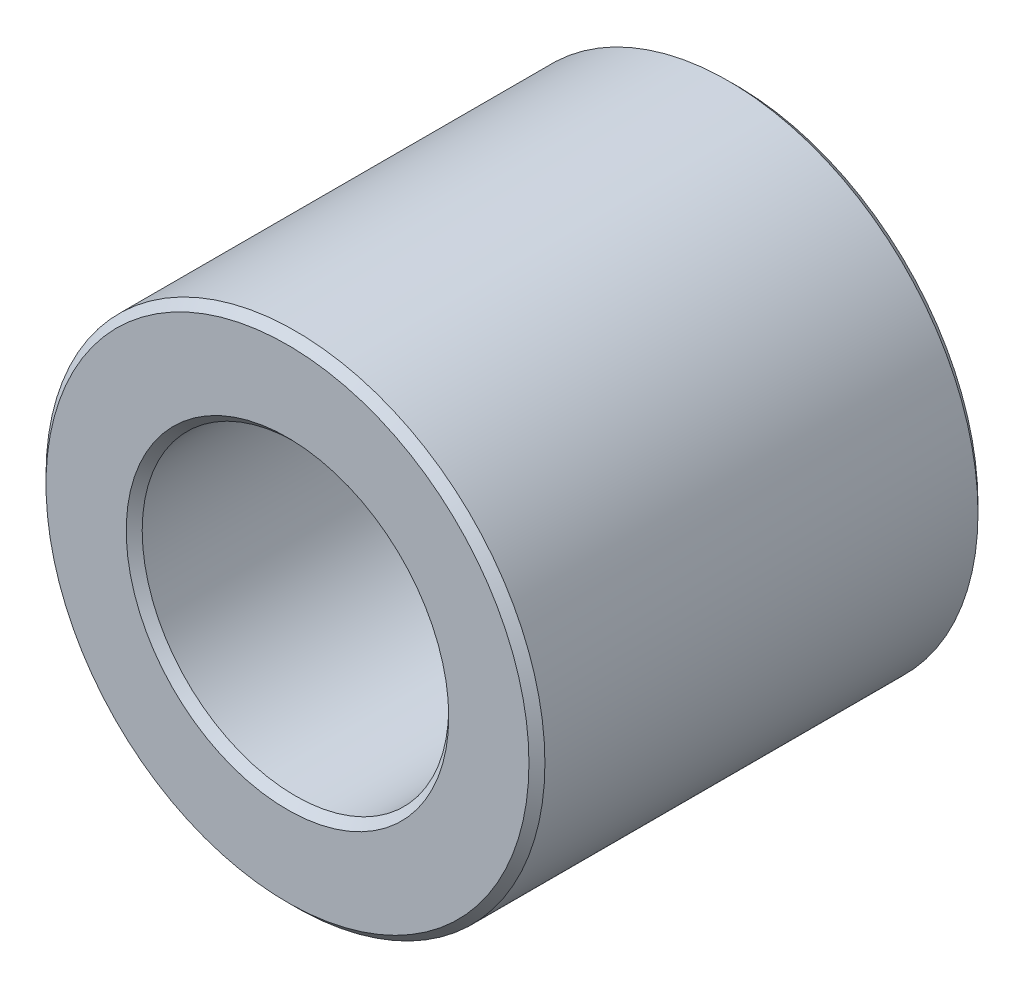
ISO-10303-21;
HEADER;
FILE_DESCRIPTION(('STEP AP214'),'2;1');
FILE_NAME('part.step','',(''),(''),'','','');
FILE_SCHEMA(('AUTOMOTIVE_DESIGN { 1 0 10303 214 1 1 1 1 }'));
ENDSEC;
DATA;
#1=APPLICATION_CONTEXT('core data for automotive mechanical design processes');
#2=APPLICATION_PROTOCOL_DEFINITION('international standard','automotive_design',2000,#1);
#3=PRODUCT_CONTEXT('',#1,'mechanical');
#4=PRODUCT('Part','Part','',(#3));
#5=PRODUCT_RELATED_PRODUCT_CATEGORY('part','',(#4));
#6=PRODUCT_DEFINITION_FORMATION('','',#4);
#7=PRODUCT_DEFINITION_CONTEXT('part definition',#1,'design');
#8=PRODUCT_DEFINITION('design','',#6,#7);
#9=PRODUCT_DEFINITION_SHAPE('','',#8);
#10=(LENGTH_UNIT() NAMED_UNIT(*) SI_UNIT(.MILLI.,.METRE.));
#11=(NAMED_UNIT(*) PLANE_ANGLE_UNIT() SI_UNIT($,.RADIAN.));
#12=(NAMED_UNIT(*) SI_UNIT($,.STERADIAN.) SOLID_ANGLE_UNIT());
#13=UNCERTAINTY_MEASURE_WITH_UNIT(LENGTH_MEASURE(1.E-05),#10,'distance_accuracy_value','');
#14=(GEOMETRIC_REPRESENTATION_CONTEXT(3) GLOBAL_UNCERTAINTY_ASSIGNED_CONTEXT((#13)) GLOBAL_UNIT_ASSIGNED_CONTEXT((#10,
#11,#12)) REPRESENTATION_CONTEXT('',''));
#15=CARTESIAN_POINT('',(0.,0.,0.));
#16=DIRECTION('',(0.,0.,1.));
#17=DIRECTION('',(1.,0.,0.));
#18=AXIS2_PLACEMENT_3D('',#15,#16,#17);
#19=CARTESIAN_POINT('',(0.,0.,-3.571875));
#20=DIRECTION('',(0.,0.,1.));
#21=DIRECTION('',(1.,0.,0.));
#22=AXIS2_PLACEMENT_3D('',#19,#20,#21);
#23=CYLINDRICAL_SURFACE('',#22,3.96875);
#24=CARTESIAN_POINT('',(0.,0.,-3.444875));
#25=DIRECTION('',(0.,0.,1.));
#26=DIRECTION('',(1.,0.,0.));
#27=AXIS2_PLACEMENT_3D('',#24,#25,#26);
#28=CIRCLE('',#27,3.96875);
#29=CARTESIAN_POINT('',(3.96875,0.,-3.444875));
#30=VERTEX_POINT('',#29);
#31=EDGE_CURVE('E10',#30,#30,#28,.T.);
#32=ORIENTED_EDGE('',*,*,#31,.T.);
#33=EDGE_LOOP('',(#32));
#34=FACE_BOUND('',#33,.T.);
#35=CARTESIAN_POINT('',(0.,0.,3.444875));
#36=DIRECTION('',(0.,0.,1.));
#37=DIRECTION('',(1.,0.,0.));
#38=AXIS2_PLACEMENT_3D('',#35,#36,#37);
#39=CIRCLE('',#38,3.96875);
#40=CARTESIAN_POINT('',(3.96875,0.,3.444875));
#41=VERTEX_POINT('',#40);
#42=EDGE_CURVE('E42',#41,#41,#39,.F.);
#43=ORIENTED_EDGE('',*,*,#42,.T.);
#44=EDGE_LOOP('',(#43));
#45=FACE_BOUND('',#44,.T.);
#46=ADVANCED_FACE('F35',(#34,#45),#23,.T.);
#47=CARTESIAN_POINT('',(0.,0.,-3.571875));
#48=DIRECTION('',(0.,0.,1.));
#49=DIRECTION('',(1.,0.,0.));
#50=AXIS2_PLACEMENT_3D('',#47,#48,#49);
#51=PLANE('',#50);
#52=CARTESIAN_POINT('',(0.,0.,-3.571875));
#53=DIRECTION('',(0.,0.,1.));
#54=DIRECTION('',(1.,0.,0.));
#55=AXIS2_PLACEMENT_3D('',#52,#53,#54);
#56=CIRCLE('',#55,2.56539999999999);
#57=CARTESIAN_POINT('',(2.56539999999999,0.,-3.571875));
#58=VERTEX_POINT('',#57);
#59=EDGE_CURVE('E61',#58,#58,#56,.T.);
#60=ORIENTED_EDGE('',*,*,#59,.T.);
#61=EDGE_LOOP('',(#60));
#62=FACE_BOUND('',#61,.T.);
#63=CARTESIAN_POINT('',(0.,0.,-3.571875));
#64=DIRECTION('',(0.,0.,1.));
#65=DIRECTION('',(1.,0.,0.));
#66=AXIS2_PLACEMENT_3D('',#63,#64,#65);
#67=CIRCLE('',#66,3.84175);
#68=CARTESIAN_POINT('',(3.84175,0.,-3.571875));
#69=VERTEX_POINT('',#68);
#70=EDGE_CURVE('E64',#69,#69,#67,.F.);
#71=ORIENTED_EDGE('',*,*,#70,.T.);
#72=EDGE_LOOP('',(#71));
#73=FACE_BOUND('',#72,.T.);
#74=ADVANCED_FACE('F68',(#62,#73),#51,.F.);
#75=CARTESIAN_POINT('',(0.,0.,-3.571875));
#76=DIRECTION('',(0.,0.,1.));
#77=DIRECTION('',(1.,0.,0.));
#78=AXIS2_PLACEMENT_3D('',#75,#76,#77);
#79=CYLINDRICAL_SURFACE('',#78,2.4384);
#80=CARTESIAN_POINT('',(0.,0.,-3.44487500000001));
#81=DIRECTION('',(0.,0.,1.));
#82=DIRECTION('',(1.,0.,0.));
#83=AXIS2_PLACEMENT_3D('',#80,#81,#82);
#84=CIRCLE('',#83,2.4384);
#85=CARTESIAN_POINT('',(2.4384,0.,-3.44487500000001));
#86=VERTEX_POINT('',#85);
#87=EDGE_CURVE('E55',#86,#86,#84,.F.);
#88=ORIENTED_EDGE('',*,*,#87,.T.);
#89=EDGE_LOOP('',(#88));
#90=FACE_BOUND('',#89,.T.);
#91=CARTESIAN_POINT('',(0.,0.,3.44487499999999));
#92=DIRECTION('',(0.,0.,1.));
#93=DIRECTION('',(1.,0.,0.));
#94=AXIS2_PLACEMENT_3D('',#91,#92,#93);
#95=CIRCLE('',#94,2.4384);
#96=CARTESIAN_POINT('',(2.4384,0.,3.44487499999999));
#97=VERTEX_POINT('',#96);
#98=EDGE_CURVE('E58',#97,#97,#95,.T.);
#99=ORIENTED_EDGE('',*,*,#98,.T.);
#100=EDGE_LOOP('',(#99));
#101=FACE_BOUND('',#100,.T.);
#102=ADVANCED_FACE('F87',(#90,#101),#79,.F.);
#103=CARTESIAN_POINT('',(0.,0.,3.571875));
#104=DIRECTION('',(0.,0.,1.));
#105=DIRECTION('',(1.,0.,0.));
#106=AXIS2_PLACEMENT_3D('',#103,#104,#105);
#107=PLANE('',#106);
#108=CARTESIAN_POINT('',(0.,0.,3.571875));
#109=DIRECTION('',(0.,0.,1.));
#110=DIRECTION('',(1.,0.,0.));
#111=AXIS2_PLACEMENT_3D('',#108,#109,#110);
#112=CIRCLE('',#111,2.56540000000001);
#113=CARTESIAN_POINT('',(2.56540000000001,0.,3.571875));
#114=VERTEX_POINT('',#113);
#115=EDGE_CURVE('E46',#114,#114,#112,.F.);
#116=ORIENTED_EDGE('',*,*,#115,.T.);
#117=EDGE_LOOP('',(#116));
#118=FACE_BOUND('',#117,.T.);
#119=CARTESIAN_POINT('',(0.,0.,3.571875));
#120=DIRECTION('',(0.,0.,1.));
#121=DIRECTION('',(1.,0.,0.));
#122=AXIS2_PLACEMENT_3D('',#119,#120,#121);
#123=CIRCLE('',#122,3.84175);
#124=CARTESIAN_POINT('',(3.84175,0.,3.571875));
#125=VERTEX_POINT('',#124);
#126=EDGE_CURVE('E50',#125,#125,#123,.T.);
#127=ORIENTED_EDGE('',*,*,#126,.T.);
#128=EDGE_LOOP('',(#127));
#129=FACE_BOUND('',#128,.T.);
#130=ADVANCED_FACE('F93',(#118,#129),#107,.T.);
#131=CARTESIAN_POINT('',(0.,0.,-3.571875));
#132=DIRECTION('',(0.,0.,-1.));
#133=DIRECTION('',(-1.,0.,0.));
#134=AXIS2_PLACEMENT_3D('',#131,#132,#133);
#135=CONICAL_SURFACE('',#134,2.56539999999999,0.785398163397447);
#136=ORIENTED_EDGE('',*,*,#87,.F.);
#137=EDGE_LOOP('',(#136));
#138=FACE_BOUND('',#137,.T.);
#139=ORIENTED_EDGE('',*,*,#59,.F.);
#140=EDGE_LOOP('',(#139));
#141=FACE_BOUND('',#140,.T.);
#142=ADVANCED_FACE('F79',(#138,#141),#135,.F.);
#143=CARTESIAN_POINT('',(0.,0.,3.44487499999999));
#144=DIRECTION('',(0.,0.,1.));
#145=DIRECTION('',(1.,0.,0.));
#146=AXIS2_PLACEMENT_3D('',#143,#144,#145);
#147=CONICAL_SURFACE('',#146,2.4384,0.785398163397453);
#148=ORIENTED_EDGE('',*,*,#115,.F.);
#149=EDGE_LOOP('',(#148));
#150=FACE_BOUND('',#149,.T.);
#151=ORIENTED_EDGE('',*,*,#98,.F.);
#152=EDGE_LOOP('',(#151));
#153=FACE_BOUND('',#152,.T.);
#154=ADVANCED_FACE('F73',(#150,#153),#147,.F.);
#155=CARTESIAN_POINT('',(0.,0.,-3.444875));
#156=DIRECTION('',(0.,0.,1.));
#157=DIRECTION('',(1.,0.,0.));
#158=AXIS2_PLACEMENT_3D('',#155,#156,#157);
#159=CONICAL_SURFACE('',#158,3.96875,0.785398163397455);
#160=ORIENTED_EDGE('',*,*,#70,.F.);
#161=EDGE_LOOP('',(#160));
#162=FACE_BOUND('',#161,.T.);
#163=ORIENTED_EDGE('',*,*,#31,.F.);
#164=EDGE_LOOP('',(#163));
#165=FACE_BOUND('',#164,.T.);
#166=ADVANCED_FACE('F70',(#162,#165),#159,.T.);
#167=CARTESIAN_POINT('',(0.,0.,3.571875));
#168=DIRECTION('',(0.,0.,-1.));
#169=DIRECTION('',(-1.,0.,0.));
#170=AXIS2_PLACEMENT_3D('',#167,#168,#169);
#171=CONICAL_SURFACE('',#170,3.84175,0.785398163397445);
#172=ORIENTED_EDGE('',*,*,#42,.F.);
#173=EDGE_LOOP('',(#172));
#174=FACE_BOUND('',#173,.T.);
#175=ORIENTED_EDGE('',*,*,#126,.F.);
#176=EDGE_LOOP('',(#175));
#177=FACE_BOUND('',#176,.T.);
#178=ADVANCED_FACE('F37',(#174,#177),#171,.T.);
#179=CLOSED_SHELL('',(#46,#74,#102,#130,#142,#154,#166,#178));
#180=MANIFOLD_SOLID_BREP('B2',#179);
#181=ADVANCED_BREP_SHAPE_REPRESENTATION('',(#18,#180),#14);
#182=SHAPE_DEFINITION_REPRESENTATION(#9,#181);
ENDSEC;
END-ISO-10303-21;
